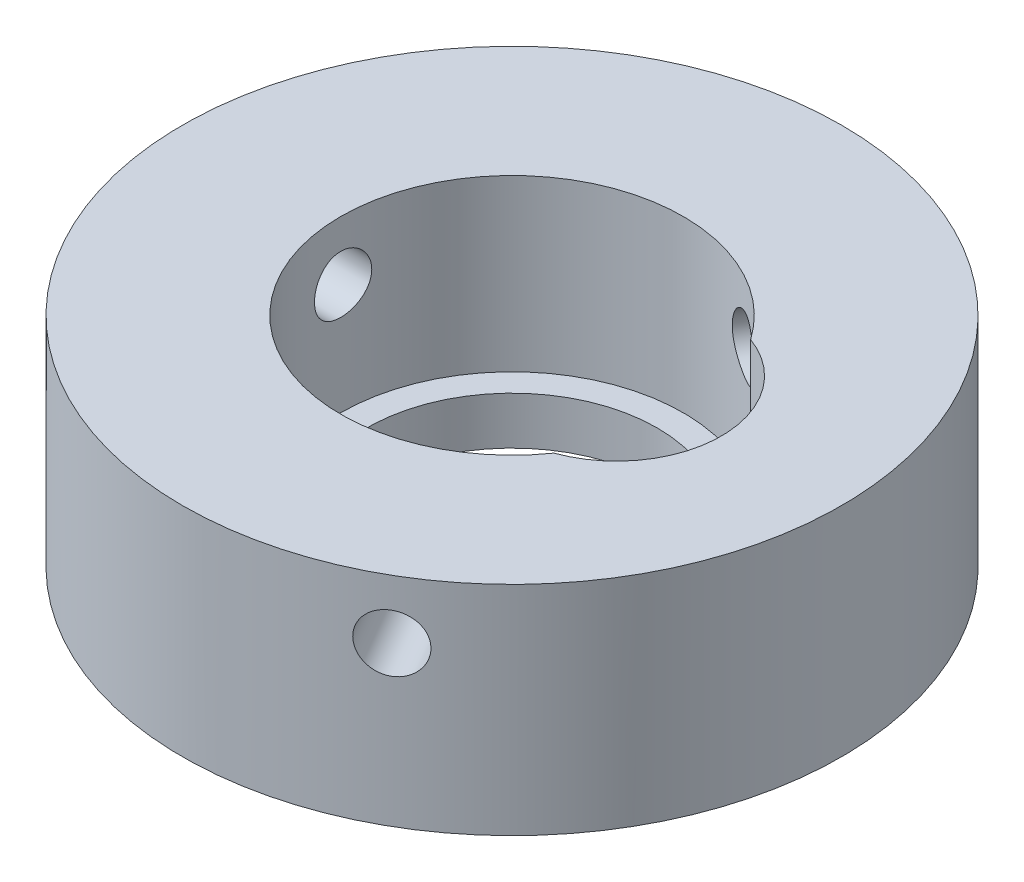
ISO-10303-21;
HEADER;
FILE_DESCRIPTION(('STEP AP214'),'2;1');
FILE_NAME('part.step','',(''),(''),'','','');
FILE_SCHEMA(('AUTOMOTIVE_DESIGN { 1 0 10303 214 1 1 1 1 }'));
ENDSEC;
DATA;
#1=APPLICATION_CONTEXT('core data for automotive mechanical design processes');
#2=APPLICATION_PROTOCOL_DEFINITION('international standard','automotive_design',2000,#1);
#3=PRODUCT_CONTEXT('',#1,'mechanical');
#4=PRODUCT('Part','Part','',(#3));
#5=PRODUCT_RELATED_PRODUCT_CATEGORY('part','',(#4));
#6=PRODUCT_DEFINITION_FORMATION('','',#4);
#7=PRODUCT_DEFINITION_CONTEXT('part definition',#1,'design');
#8=PRODUCT_DEFINITION('design','',#6,#7);
#9=PRODUCT_DEFINITION_SHAPE('','',#8);
#10=(LENGTH_UNIT() NAMED_UNIT(*) SI_UNIT(.MILLI.,.METRE.));
#11=(NAMED_UNIT(*) PLANE_ANGLE_UNIT() SI_UNIT($,.RADIAN.));
#12=(NAMED_UNIT(*) SI_UNIT($,.STERADIAN.) SOLID_ANGLE_UNIT());
#13=UNCERTAINTY_MEASURE_WITH_UNIT(LENGTH_MEASURE(1.E-05),#10,'distance_accuracy_value','');
#14=(GEOMETRIC_REPRESENTATION_CONTEXT(3) GLOBAL_UNCERTAINTY_ASSIGNED_CONTEXT((#13)) GLOBAL_UNIT_ASSIGNED_CONTEXT((#10,
#11,#12)) REPRESENTATION_CONTEXT('',''));
#15=CARTESIAN_POINT('',(0.,0.,0.));
#16=DIRECTION('',(0.,0.,1.));
#17=DIRECTION('',(1.,0.,0.));
#18=AXIS2_PLACEMENT_3D('',#15,#16,#17);
#19=CARTESIAN_POINT('',(0.,6.5,0.));
#20=DIRECTION('',(0.,1.,0.));
#21=DIRECTION('',(0.,0.,1.));
#22=AXIS2_PLACEMENT_3D('',#19,#20,#21);
#23=PLANE('',#22);
#24=CARTESIAN_POINT('',(4.,6.5,0.));
#25=DIRECTION('',(0.,1.,0.));
#26=DIRECTION('',(0.,0.,-1.));
#27=AXIS2_PLACEMENT_3D('',#24,#25,#26);
#28=CIRCLE('',#27,4.);
#29=CARTESIAN_POINT('',(5.3628125,6.5,3.76068372637792));
#30=VERTEX_POINT('',#29);
#31=CARTESIAN_POINT('',(5.3628125,6.5,-3.76068372637792));
#32=VERTEX_POINT('',#31);
#33=EDGE_CURVE('E72',#30,#32,#28,.T.);
#34=ORIENTED_EDGE('',*,*,#33,.F.);
#35=CARTESIAN_POINT('',(0.,6.5,0.));
#36=DIRECTION('',(0.,1.,0.));
#37=DIRECTION('',(0.,0.,1.));
#38=AXIS2_PLACEMENT_3D('',#35,#36,#37);
#39=CIRCLE('',#38,6.55);
#40=EDGE_CURVE('E49',#32,#30,#39,.T.);
#41=ORIENTED_EDGE('',*,*,#40,.F.);
#42=EDGE_LOOP('',(#34,#41));
#43=FACE_BOUND('',#42,.T.);
#44=CARTESIAN_POINT('',(0.,6.5,0.));
#45=DIRECTION('',(0.,1.,0.));
#46=DIRECTION('',(0.,0.,1.));
#47=AXIS2_PLACEMENT_3D('',#44,#45,#46);
#48=CIRCLE('',#47,12.6);
#49=CARTESIAN_POINT('',(0.,6.5,12.6));
#50=VERTEX_POINT('',#49);
#51=EDGE_CURVE('E11',#50,#50,#48,.T.);
#52=ORIENTED_EDGE('',*,*,#51,.T.);
#53=EDGE_LOOP('',(#52));
#54=FACE_BOUND('',#53,.T.);
#55=ADVANCED_FACE('F35',(#43,#54),#23,.T.);
#56=CARTESIAN_POINT('',(0.,6.5,0.));
#57=DIRECTION('',(0.,-1.,0.));
#58=DIRECTION('',(0.,0.,-1.));
#59=AXIS2_PLACEMENT_3D('',#56,#57,#58);
#60=CYLINDRICAL_SURFACE('',#59,12.6);
#61=CARTESIAN_POINT('',(7.22446254968569,4.25,-10.3231361934341));
#62=CARTESIAN_POINT('',(7.22446054632938,4.31138190041357,-10.3231380778271));
#63=CARTESIAN_POINT('',(7.22020525135826,4.3728053496494,-10.3261196405773));
#64=CARTESIAN_POINT('',(7.20327426813458,4.49395204996664,-10.3379370419349));
#65=CARTESIAN_POINT('',(7.19058909087164,4.55367330589645,-10.3467794777445));
#66=CARTESIAN_POINT('',(7.1571126381412,4.66964351735145,-10.3699638739023));
#67=CARTESIAN_POINT('',(7.13632602160388,4.72589444707592,-10.3843026733548));
#68=CARTESIAN_POINT('',(7.08715996500609,4.83335975790643,-10.4179194769588));
#69=CARTESIAN_POINT('',(7.05878212519421,4.88457519739809,-10.4371964400971));
#70=CARTESIAN_POINT('',(6.99504860636771,4.98067122809165,-10.4800175655039));
#71=CARTESIAN_POINT('',(6.95967588767177,5.02553588138808,-10.5035721364489));
#72=CARTESIAN_POINT('',(6.88287680265401,5.10751980423676,-10.5540567665992));
#73=CARTESIAN_POINT('',(6.84145016953447,5.14463873225758,-10.5809869745623));
#74=CARTESIAN_POINT('',(6.75352876147299,5.21013105315307,-10.6373199291252));
#75=CARTESIAN_POINT('',(6.70702610678926,5.23849057940443,-10.6667265032577));
#76=CARTESIAN_POINT('',(6.61022938958786,5.28557037598155,-10.7269806566784));
#77=CARTESIAN_POINT('',(6.55993539862725,5.30429082818142,-10.7578282087657));
#78=CARTESIAN_POINT('',(6.45705377709052,5.33151498346011,-10.8198916159108));
#79=CARTESIAN_POINT('',(6.40447231051077,5.340044570597,-10.8511063336461));
#80=CARTESIAN_POINT('',(6.29836533493609,5.34672490320569,-10.9130365567474));
#81=CARTESIAN_POINT('',(6.24483984489786,5.34487585685233,-10.9437520721141));
#82=CARTESIAN_POINT('',(6.1385239494038,5.33087254705099,-11.0037375601458));
#83=CARTESIAN_POINT('',(6.08573194957235,5.318746117655,-11.0330112114242));
#84=CARTESIAN_POINT('',(5.98227325885859,5.28457556248007,-11.089449101339));
#85=CARTESIAN_POINT('',(5.93160658969815,5.26253133536357,-11.1166133184184));
#86=CARTESIAN_POINT('',(5.83383422975394,5.20912001799512,-11.1682336036245));
#87=CARTESIAN_POINT('',(5.7867333948661,5.17774049171027,-11.1926859991652));
#88=CARTESIAN_POINT('',(5.69758648682256,5.10655835504873,-11.23832817445));
#89=CARTESIAN_POINT('',(5.65554052534332,5.06675555863177,-11.259517882115));
#90=CARTESIAN_POINT('',(5.57766287630413,4.97969992891863,-11.2982998622308));
#91=CARTESIAN_POINT('',(5.5418521896816,4.93242290415074,-11.3158800116916));
#92=CARTESIAN_POINT('',(5.47774137850233,4.83184505934226,-11.3470535494254));
#93=CARTESIAN_POINT('',(5.44944126095321,4.77854423368131,-11.3606469339787));
#94=CARTESIAN_POINT('',(5.40125625508503,4.66741445565701,-11.3836350598867));
#95=CARTESIAN_POINT('',(5.3813725376264,4.60958487459407,-11.3930292170696));
#96=CARTESIAN_POINT('',(5.35067792689323,4.49104749407922,-11.4074771990805));
#97=CARTESIAN_POINT('',(5.33986682592476,4.43033976054873,-11.4125311232669));
#98=CARTESIAN_POINT('',(5.32769610946084,4.30798167070344,-11.4182179011114));
#99=CARTESIAN_POINT('',(5.32630573053385,4.24633504200532,-11.4188651448478));
#100=CARTESIAN_POINT('',(5.33294098558819,4.12366258093429,-11.4157677501991));
#101=CARTESIAN_POINT('',(5.34096652393116,4.0626367422623,-11.4120231564223));
#102=CARTESIAN_POINT('',(5.36614757583747,3.94303559759384,-11.4002039961788));
#103=CARTESIAN_POINT('',(5.38328873741891,3.88445659514293,-11.3921362361167));
#104=CARTESIAN_POINT('',(5.42613323851181,3.77129738297897,-11.3717912930023));
#105=CARTESIAN_POINT('',(5.45183672720363,3.71671724295782,-11.3595140366083));
#106=CARTESIAN_POINT('',(5.51106026402271,3.61295036659126,-11.3309000086631));
#107=CARTESIAN_POINT('',(5.54460031712976,3.5637779154396,-11.3145528404228));
#108=CARTESIAN_POINT('',(5.61840497720261,3.47236671658474,-11.2780856243806));
#109=CARTESIAN_POINT('',(5.65866970993669,3.43012809859083,-11.2579655060141));
#110=CARTESIAN_POINT('',(5.74479773013916,3.35366783154427,-11.214260247924));
#111=CARTESIAN_POINT('',(5.79067587205511,3.31946818507753,-11.1906658794339));
#112=CARTESIAN_POINT('',(5.88654342688131,3.26020771846546,-11.1405353745494));
#113=CARTESIAN_POINT('',(5.93653279562105,3.23514680015045,-11.1139992697596));
#114=CARTESIAN_POINT('',(6.03904970180259,3.19491286340649,-11.0586285371013));
#115=CARTESIAN_POINT('',(6.0915736562985,3.17972630217402,-11.0297971185005));
#116=CARTESIAN_POINT('',(6.19767205109089,3.15962792029821,-10.9705310595895));
#117=CARTESIAN_POINT('',(6.251246469565,3.15471588643926,-10.9400964525619));
#118=CARTESIAN_POINT('',(6.35771920527344,3.15530858008166,-10.8785649328174));
#119=CARTESIAN_POINT('',(6.41061916839156,3.16077904446588,-10.8474705322635));
#120=CARTESIAN_POINT('',(6.51443964881388,3.18190991865538,-10.7854408430448));
#121=CARTESIAN_POINT('',(6.56536016362865,3.19757034127556,-10.7545055545803));
#122=CARTESIAN_POINT('',(6.66383351813408,3.23862771773234,-10.6937679081021));
#123=CARTESIAN_POINT('',(6.71138659844867,3.2640239750502,-10.6639654692101));
#124=CARTESIAN_POINT('',(6.8018781794154,3.32382826023661,-10.6064758765885));
#125=CARTESIAN_POINT('',(6.84481674380046,3.35823616361917,-10.5787886936458));
#126=CARTESIAN_POINT('',(6.92511255226378,3.4352156861183,-10.526401360722));
#127=CARTESIAN_POINT('',(6.96245176847016,3.47781270757594,-10.5017109057798));
#128=CARTESIAN_POINT('',(7.03045902743075,3.56991427912192,-10.4563053996972));
#129=CARTESIAN_POINT('',(7.06112545546964,3.61942049638614,-10.4355913109207));
#130=CARTESIAN_POINT('',(7.11507168024247,3.72403940057251,-10.3988857592597));
#131=CARTESIAN_POINT('',(7.13833654848251,3.77916312586256,-10.3829038453234));
#132=CARTESIAN_POINT('',(7.17680142000273,3.89333498043019,-10.3563542166863));
#133=CARTESIAN_POINT('',(7.19201066076509,3.95237852695042,-10.3457803010513));
#134=CARTESIAN_POINT('',(7.21014281671796,4.05147307579422,-10.3331462381805));
#135=CARTESIAN_POINT('',(7.21550646863618,4.09088746924477,-10.3293990996287));
#136=CARTESIAN_POINT('',(7.22266698112272,4.170195387516,-10.3243934683269));
#137=CARTESIAN_POINT('',(7.2244638522868,4.21008891091298,-10.323134968184));
#138=CARTESIAN_POINT('',(7.22446254968569,4.25,-10.3231361934341));
#139=B_SPLINE_CURVE_WITH_KNOTS('',3,(#61,#62,#63,#64,#65,#66,#67,#68,#69,#70,#71,#72,#73,#74,
#75,#76,#77,#78,#79,#80,#81,#82,#83,#84,#85,#86,#87,#88,#89,#90,#91,#92,#93,#94,#95,#96,#97,#98,
#99,#100,#101,#102,#103,#104,#105,#106,#107,#108,#109,#110,#111,#112,#113,#114,#115,#116,#117,
#118,#119,#120,#121,#122,#123,#124,#125,#126,#127,#128,#129,#130,#131,#132,#133,#134,#135,#136,
#137,#138),.UNSPECIFIED.,.T.,.F.,(4,2,2,2,2,2,2,2,2,2,2,2,2,2,2,2,2,2,2,2,2,2,2,2,2,2,2,2,2,2,2,
2,2,2,2,2,2,2,4),(0.,0.183999973409161,0.368207416119459,0.552309081784561,0.736371968905574,
0.920888887003559,1.10541393926801,1.29022962530517,1.47504182403439,1.65938360844299,
1.84372169533334,2.02756213218092,2.2114044475064,2.39549277374776,2.57958516627414,
2.76428608320509,2.94898717246786,3.13371394826874,3.31843649511618,3.5025555372855,
3.6866727093563,3.87050085489987,4.05433220342594,4.23863806050253,4.42294736494475,
4.60775539647024,4.79256144270026,4.97711348748461,5.16166170243178,5.34560195152885,
5.52954243194962,5.71346975539987,5.89739453823011,6.08189933330301,6.26644872625743,
6.4513680183193,6.63607479964511,6.75571366870821,6.87535218236229),.UNSPECIFIED.);
#140=CARTESIAN_POINT('',(7.22446254968569,4.25,-10.3231361934341));
#141=VERTEX_POINT('',#140);
#142=EDGE_CURVE('E121',#141,#141,#139,.T.);
#143=ORIENTED_EDGE('',*,*,#142,.T.);
#144=EDGE_LOOP('',(#143));
#145=FACE_BOUND('',#144,.T.);
#146=CARTESIAN_POINT('',(5.32786691539762,4.25,11.4181361934342));
#147=CARTESIAN_POINT('',(5.32786954900797,4.31138190041357,11.4181354006732));
#148=CARTESIAN_POINT('',(5.33257930557823,4.3728053496494,11.4159409885028));
#149=CARTESIAN_POINT('',(5.35127896697244,4.49395204996664,11.4071870275988));
#150=CARTESIAN_POINT('',(5.36527932964632,4.55367330589645,11.4006225597424));
#151=CARTESIAN_POINT('',(5.40209583205566,4.66964351735145,11.3832232993281));
#152=CARTESIAN_POINT('',(5.42490690490988,4.72589444707592,11.3723909610743));
#153=CARTESIAN_POINT('',(5.47860293912391,4.83335975790643,11.3466203088587));
#154=CARTESIAN_POINT('',(5.50948619881542,4.88457519739809,11.3316828602463));
#155=CARTESIAN_POINT('',(5.5784371406496,4.98067122809165,11.2978985765733));
#156=CARTESIAN_POINT('',(5.61652235681122,5.02553588138808,11.2790421890543));
#157=CARTESIAN_POINT('',(5.69864287153093,5.10751980423676,11.2377745455166));
#158=CARTESIAN_POINT('',(5.74267843231593,5.14463873225757,11.2153631328234));
#159=CARTESIAN_POINT('',(5.83542490606832,5.21013105315307,11.1673874371871));
#160=CARTESIAN_POINT('',(5.88414307364724,5.23849057940443,11.1418182439538));
#161=CARTESIAN_POINT('',(5.98472305979383,5.28557037598155,11.0881169045648));
#162=CARTESIAN_POINT('',(6.03658481902625,5.30429082818142,11.0599848067789));
#163=CARTESIAN_POINT('',(6.14177411702773,5.33151498346011,11.0019184125181));
#164=CARTESIAN_POINT('',(6.1950975888483,5.340044570597,10.9719888855594));
#165=CARTESIAN_POINT('',(6.30178422310341,5.34672490320569,10.9110626607437));
#166=CARTESIAN_POINT('',(6.35514738472039,5.34487585685233,10.8800659843039));
#167=CARTESIAN_POINT('',(6.46025428896133,5.33087254705099,10.8179864619958));
#168=CARTESIAN_POINT('',(6.51200201454566,5.318746117655,10.7869040746644));
#169=CARTESIAN_POINT('',(6.61260800630471,5.28457556248007,10.7255251652214));
#170=CARTESIAN_POINT('',(6.66146624294959,5.26253133536357,10.695228651143));
#171=CARTESIAN_POINT('',(6.75505690126086,5.20912001799512,10.6363654462464));
#172=CARTESIAN_POINT('',(6.7997837144264,5.17774049171027,10.6078011244645));
#173=CARTESIAN_POINT('',(6.88388445172878,5.10655835504873,10.5534187250723));
#174=CARTESIAN_POINT('',(6.92325825760505,5.06675555863177,10.5276007081372));
#175=CARTESIAN_POINT('',(6.99578326211397,4.97969992891863,10.4795476757402));
#176=CARTESIAN_POINT('',(7.0289134614606,4.93242290415074,10.4573247861285));
#177=CARTESIAN_POINT('',(7.08796594265359,4.83184505934226,10.417389963857));
#178=CARTESIAN_POINT('',(7.11388821777471,4.77854423368131,10.399678035406));
#179=CARTESIAN_POINT('',(7.15788902173051,4.66741445565701,10.3694426591966));
#180=CARTESIAN_POINT('',(7.17596645922734,4.60958487459407,10.3569199333472));
#181=CARTESIAN_POINT('',(7.2038260840488,4.49104749407923,10.3375616116985));
#182=CARTESIAN_POINT('',(7.21360846126725,4.43033976054873,10.3307258857101));
#183=CARTESIAN_POINT('',(7.22461871357824,4.30798167070344,10.3230291249923));
#184=CARTESIAN_POINT('',(7.22587443255992,4.24633504200533,10.3221486433889));
#185=CARTESIAN_POINT('',(7.2198743825814,4.12366258093429,10.3263462455022));
#186=CARTESIAN_POINT('',(7.21261870007232,4.06263674226229,10.3314242686978));
#187=CARTESIAN_POINT('',(7.18979248109696,3.94303559759384,10.347322119221));
#188=CARTESIAN_POINT('',(7.1742350151408,3.88445659514293,10.3581329205698));
#189=CARTESIAN_POINT('',(7.1351935270187,3.77129738297897,10.3850648753715));
#190=CARTESIAN_POINT('',(7.11170936674686,3.71671724295782,10.4011861213475));
#191=CARTESIAN_POINT('',(7.05731712323215,3.61295036659126,10.4381681947622));
#192=CARTESIAN_POINT('',(7.02639003370262,3.5637779154396,10.4590411486771));
#193=CARTESIAN_POINT('',(6.95790616816829,3.47236671658474,10.5047242511967));
#194=CARTESIAN_POINT('',(6.92034926816874,3.43012809859083,10.5295344734378));
#195=CARTESIAN_POINT('',(6.83943539428253,3.35366783154427,10.5822708978657));
#196=CARTESIAN_POINT('',(6.79606300082586,3.31946818507754,10.6102053499983));
#197=CARTESIAN_POINT('',(6.70471493267826,3.26020771846546,10.6681638354342));
#198=CARTESIAN_POINT('',(6.65673930744296,3.23514680015045,10.6981878462871));
#199=CARTESIAN_POINT('',(6.55752839324394,3.19491286340649,10.7592847250286));
#200=CARTESIAN_POINT('',(6.50629767506051,3.17972630217402,10.7903560946288));
#201=CARTESIAN_POINT('',(6.40192256506521,3.15962792029821,10.8526069703643));
#202=CARTESIAN_POINT('',(6.34877821298811,3.15471588643926,10.8837864742421));
#203=CARTESIAN_POINT('',(6.24225398590167,3.15530858008166,10.9452288083037));
#204=CARTESIAN_POINT('',(6.18887546354746,3.16077904446588,10.9754943199463));
#205=CARTESIAN_POINT('',(6.08324593668409,3.18190991865538,11.0343906488158));
#206=CARTESIAN_POINT('',(6.03099493359297,3.19757034127556,11.0630214639869));
#207=CARTESIAN_POINT('',(5.9291579115241,3.23862771773234,11.1179330673454));
#208=CARTESIAN_POINT('',(5.8795717021916,3.2640239750502,11.1442140234801));
#209=CARTESIAN_POINT('',(5.78453846404473,3.32382826023661,11.1938372351151));
#210=CARTESIAN_POINT('',(5.73909137806461,3.35823616361917,11.2171795312032));
#211=CARTESIAN_POINT('',(5.65357471268443,3.4352156861183,11.260524074688));
#212=CARTESIAN_POINT('',(5.61352254337026,3.47781270757594,11.280515557009));
#213=CARTESIAN_POINT('',(5.54019659215071,3.56991427912192,11.3167088178693));
#214=CARTESIAN_POINT('',(5.50692445103457,3.61942049638614,11.332909679206));
#215=CARTESIAN_POINT('',(5.44816339844988,3.72403940057251,11.3612757044671));
#216=CARTESIAN_POINT('',(5.42269022085992,3.77916312586256,11.3734327144105));
#217=CARTESIAN_POINT('',(5.38046513223905,3.89333498043019,11.3934694559818));
#218=CARTESIAN_POINT('',(5.36370323230042,3.95237852695042,11.4013540870367));
#219=CARTESIAN_POINT('',(5.34369573492489,4.05147307579422,11.4107399632819));
#220=CARTESIAN_POINT('',(5.33776879178841,4.09088746924477,11.4135114528242));
#221=CARTESIAN_POINT('',(5.32985353167584,4.170195387516,11.4172098228908));
#222=CARTESIAN_POINT('',(5.32786520299939,4.21008891091298,11.4181367088948));
#223=CARTESIAN_POINT('',(5.32786691539762,4.25,11.4181361934342));
#224=B_SPLINE_CURVE_WITH_KNOTS('',3,(#146,#147,#148,#149,#150,#151,#152,#153,#154,#155,#156,
#157,#158,#159,#160,#161,#162,#163,#164,#165,#166,#167,#168,#169,#170,#171,#172,#173,#174,#175,
#176,#177,#178,#179,#180,#181,#182,#183,#184,#185,#186,#187,#188,#189,#190,#191,#192,#193,#194,
#195,#196,#197,#198,#199,#200,#201,#202,#203,#204,#205,#206,#207,#208,#209,#210,#211,#212,#213,
#214,#215,#216,#217,#218,#219,#220,#221,#222,#223),.UNSPECIFIED.,.T.,.F.,(4,2,2,2,2,2,2,2,2,2,2,
2,2,2,2,2,2,2,2,2,2,2,2,2,2,2,2,2,2,2,2,2,2,2,2,2,2,2,4),(0.,0.183999973409161,
0.368207416119459,0.55230908178456,0.736371968905574,0.920888887003557,1.10541393926801,
1.29022962530517,1.47504182403439,1.65938360844299,1.84372169533334,2.02756213218092,
2.2114044475064,2.39549277374776,2.57958516627414,2.76428608320509,2.94898717246786,
3.13371394826873,3.31843649511618,3.5025555372855,3.6866727093563,3.87050085489987,
4.05433220342594,4.23863806050253,4.42294736494474,4.60775539647024,4.79256144270026,
4.97711348748461,5.16166170243178,5.34560195152885,5.52954243194962,5.71346975539987,
5.89739453823012,6.08189933330302,6.26644872625743,6.4513680183193,6.63607479964511,
6.75571366870821,6.87535218236229),.UNSPECIFIED.);
#225=CARTESIAN_POINT('',(5.32786691539762,4.25,11.4181361934342));
#226=VERTEX_POINT('',#225);
#227=EDGE_CURVE('E126',#226,#226,#224,.T.);
#228=ORIENTED_EDGE('',*,*,#227,.T.);
#229=EDGE_LOOP('',(#228));
#230=FACE_BOUND('',#229,.T.);
#231=CARTESIAN_POINT('',(-12.6,3.155,0.));
#232=CARTESIAN_POINT('',(-12.599999378538,3.15500267670996,-0.0613823939407758));
#233=CARTESIAN_POINT('',(-12.5995466739457,3.16017873204988,-0.122806335110146));
#234=CARTESIAN_POINT('',(-12.5977842727679,3.18075044278816,-0.243954057554232));
#235=CARTESIAN_POINT('',(-12.596473610616,3.19615761281609,-0.303675844063358));
#236=CARTESIAN_POINT('',(-12.5931433735136,3.2367420486149,-0.419647177324462));
#237=CARTESIAN_POINT('',(-12.5911242051424,3.26191371186407,-0.475898693782604));
#238=CARTESIAN_POINT('',(-12.5866032628457,3.32130240521609,-0.583364987291514));
#239=CARTESIAN_POINT('',(-12.5841015907313,3.35551752766176,-0.634580823462938));
#240=CARTESIAN_POINT('',(-12.5788885482659,3.43212365391641,-0.73067640447554));
#241=CARTESIAN_POINT('',(-12.5761766797403,3.47453446015344,-0.775540337473936));
#242=CARTESIAN_POINT('',(-12.5708530566498,3.56628612719011,-0.857522870639881));
#243=CARTESIAN_POINT('',(-12.5682413065323,3.61562729538501,-0.894641127067387));
#244=CARTESIAN_POINT('',(-12.5634083387206,3.71993555089241,-0.960132747049468));
#245=CARTESIAN_POINT('',(-12.5611877482217,3.77491145382139,-0.988492120254343));
#246=CARTESIAN_POINT('',(-12.557394339054,3.88886724132394,-1.03557159645859));
#247=CARTESIAN_POINT('',(-12.5558215080405,3.94784704956782,-1.05429188315734));
#248=CARTESIAN_POINT('',(-12.5535059620276,4.06797732873152,-1.08151569057194));
#249=CARTESIAN_POINT('',(-12.5527611453939,4.12912189577661,-1.09004508156486));
#250=CARTESIAN_POINT('',(-12.5521793446786,4.25197897432415,-1.0967249102072));
#251=CARTESIAN_POINT('',(-12.5523423422039,4.3136914742945,-1.09487555813848));
#252=CARTESIAN_POINT('',(-12.5535558410754,4.43575513222471,-1.08087176586757));
#253=CARTESIAN_POINT('',(-12.5546039187453,4.49610954622208,-1.06874546741439));
#254=CARTESIAN_POINT('',(-12.5574656875802,4.61392316390629,-1.03457573786452));
#255=CARTESIAN_POINT('',(-12.5592793867959,4.6713823371412,-1.01253220248328));
#256=CARTESIAN_POINT('',(-12.5634708300567,4.78186394473554,-0.959122314205401));
#257=CARTESIAN_POINT('',(-12.5658493354153,4.83488025883707,-0.927743363352328));
#258=CARTESIAN_POINT('',(-12.5709017027853,4.93490427142175,-0.856562453127345));
#259=CARTESIAN_POINT('',(-12.5735755713087,4.9819118373781,-0.81676030802787));
#260=CARTESIAN_POINT('',(-12.5789281731273,5.06874759138496,-0.729705138366363));
#261=CARTESIAN_POINT('',(-12.581606893055,5.10855139891937,-0.682427789848149));
#262=CARTESIAN_POINT('',(-12.5866589220389,5.17966115485633,-0.581849024191848));
#263=CARTESIAN_POINT('',(-12.5890322308667,5.21096709690525,-0.528547602549758));
#264=CARTESIAN_POINT('',(-12.5932065438654,5.2641910508039,-0.417417667195347));
#265=CARTESIAN_POINT('',(-12.5950074802952,5.28610795155474,-0.359588618641005));
#266=CARTESIAN_POINT('',(-12.5978333752601,5.31991445401443,-0.241052394984881));
#267=CARTESIAN_POINT('',(-12.5988583513109,5.33180428206463,-0.180345284882322));
#268=CARTESIAN_POINT('',(-12.6000145905234,5.34518849093118,-0.0579874784925198));
#269=CARTESIAN_POINT('',(-12.6001487482587,5.34671654105603,0.00365950866383441));
#270=CARTESIAN_POINT('',(-12.5995159719086,5.33942206590252,0.126332764824102));
#271=CARTESIAN_POINT('',(-12.5987490469757,5.33059964575668,0.187359040126403));
#272=CARTESIAN_POINT('',(-12.5964022006606,5.30288257777896,0.306962323456914));
#273=CARTESIAN_POINT('',(-12.5948235416419,5.28400356775832,0.365542982277124));
#274=CARTESIAN_POINT('',(-12.5910305201997,5.23672521747446,0.478705308533921));
#275=CARTESIAN_POINT('',(-12.5888161468772,5.20832571398485,0.53328690738811));
#276=CARTESIAN_POINT('',(-12.5839926038596,5.1427281447199,0.637054767799256));
#277=CARTESIAN_POINT('',(-12.5813824410779,5.10550781024721,0.686226905162626));
#278=CARTESIAN_POINT('',(-12.5760638001585,5.02335724810114,0.777637371912563));
#279=CARTESIAN_POINT('',(-12.5733553201633,4.97842687471635,0.819875570225645));
#280=CARTESIAN_POINT('',(-12.5681367100148,4.88198537747339,0.896334944540244));
#281=CARTESIAN_POINT('',(-12.5656271362536,4.83045678031383,0.93053412397085));
#282=CARTESIAN_POINT('',(-12.5610984916624,4.72236836010913,0.989793770867939));
#283=CARTESIAN_POINT('',(-12.5590794155689,4.66580859106111,1.01485433640002));
#284=CARTESIAN_POINT('',(-12.5557635774664,4.5493407493914,1.05508803672387));
#285=CARTESIAN_POINT('',(-12.5544658376156,4.48943733130951,1.07027456151013));
#286=CARTESIAN_POINT('',(-12.5527363881166,4.36791906937635,1.09037265700947));
#287=CARTESIAN_POINT('',(-12.5523046602146,4.30630426162563,1.09528444429435));
#288=CARTESIAN_POINT('',(-12.5523564088244,4.18333084229994,1.09469103731639));
#289=CARTESIAN_POINT('',(-12.5528368490467,4.12197205972793,1.08922040254002));
#290=CARTESIAN_POINT('',(-12.5546523448622,4.00104834308837,1.06808958522424));
#291=CARTESIAN_POINT('',(-12.5559874016984,3.94148341162987,1.05242938786556));
#292=CARTESIAN_POINT('',(-12.5593608962419,3.82583649008619,1.01137289762092));
#293=CARTESIAN_POINT('',(-12.5613992830778,3.7697542484459,0.985977308876168));
#294=CARTESIAN_POINT('',(-12.5659498535577,3.66264347154389,0.926174717432325));
#295=CARTESIAN_POINT('',(-12.5684620307233,3.61161486719464,0.891767837948725));
#296=CARTESIAN_POINT('',(-12.5736870870937,3.51588292404015,0.814789435013228));
#297=CARTESIAN_POINT('',(-12.5764005796017,3.47120023269641,0.772192275503083));
#298=CARTESIAN_POINT('',(-12.5817169144785,3.3896000088752,0.680090118497114));
#299=CARTESIAN_POINT('',(-12.5843197299712,3.35268435399799,0.630583455500698));
#300=CARTESIAN_POINT('',(-12.5891265485144,3.28761202617025,0.525964194765321));
#301=CARTESIAN_POINT('',(-12.591329747723,3.25947292755834,0.470840638618948));
#302=CARTESIAN_POINT('',(-12.5950798334602,3.21288618368963,0.356669144163046));
#303=CARTESIAN_POINT('',(-12.5966274711532,3.19442744054947,0.297625787554577));
#304=CARTESIAN_POINT('',(-12.5984964277923,3.17240694284877,0.19853071222781));
#305=CARTESIAN_POINT('',(-12.5990576881621,3.16588806342225,0.159115562869924));
#306=CARTESIAN_POINT('',(-12.5998096757652,3.15718372812955,0.0798061298718351));
#307=CARTESIAN_POINT('',(-12.6000004040849,3.15499825955892,0.0399118476366721));
#308=CARTESIAN_POINT('',(-12.6,3.155,0.));
#309=B_SPLINE_CURVE_WITH_KNOTS('',3,(#231,#232,#233,#234,#235,#236,#237,#238,#239,#240,#241,
#242,#243,#244,#245,#246,#247,#248,#249,#250,#251,#252,#253,#254,#255,#256,#257,#258,#259,#260,
#261,#262,#263,#264,#265,#266,#267,#268,#269,#270,#271,#272,#273,#274,#275,#276,#277,#278,#279,
#280,#281,#282,#283,#284,#285,#286,#287,#288,#289,#290,#291,#292,#293,#294,#295,#296,#297,#298,
#299,#300,#301,#302,#303,#304,#305,#306,#307,#308),.UNSPECIFIED.,.T.,.F.,(4,2,2,2,2,2,2,2,2,2,2,
2,2,2,2,2,2,2,2,2,2,2,2,2,2,2,2,2,2,2,2,2,2,2,2,2,2,2,4),(0.,0.184001455768908,
0.368210348134743,0.552313703894763,0.736378255235361,0.92089323367748,1.10541639884207,
1.29023279201642,1.47504566287414,1.65938837013705,1.84372734247863,2.027563157432,
2.21140090555318,2.39548787312269,2.57957890014829,2.76428176904525,2.94898477603945,
3.13370963474856,3.31843032354753,3.50255049660937,3.68666879952891,3.87050163408092,
4.05433762056038,4.2386427506131,4.42295136421743,4.60775856542627,4.79256378342831,
4.97711786506645,5.16166805661882,5.34560502175183,5.52954225439556,5.7134661857399,
5.89738760233969,6.08189436186204,6.26644567285725,6.45136419485204,6.63607025405664,
6.75571139423461,6.87535218365478),.UNSPECIFIED.);
#310=CARTESIAN_POINT('',(-12.6,3.155,0.));
#311=VERTEX_POINT('',#310);
#312=EDGE_CURVE('E84',#311,#311,#309,.T.);
#313=ORIENTED_EDGE('',*,*,#312,.T.);
#314=EDGE_LOOP('',(#313));
#315=FACE_BOUND('',#314,.T.);
#316=ORIENTED_EDGE('',*,*,#51,.F.);
#317=EDGE_LOOP('',(#316));
#318=FACE_BOUND('',#317,.T.);
#319=CARTESIAN_POINT('',(0.,-1.82,0.));
#320=DIRECTION('',(0.,-1.,0.));
#321=DIRECTION('',(0.,0.,-1.));
#322=AXIS2_PLACEMENT_3D('',#319,#320,#321);
#323=CIRCLE('',#322,12.6);
#324=CARTESIAN_POINT('',(0.,-1.82,-12.6));
#325=VERTEX_POINT('',#324);
#326=EDGE_CURVE('E95',#325,#325,#323,.T.);
#327=ORIENTED_EDGE('',*,*,#326,.F.);
#328=EDGE_LOOP('',(#327));
#329=FACE_BOUND('',#328,.T.);
#330=ADVANCED_FACE('F37',(#145,#230,#315,#318,#329),#60,.T.);
#331=CARTESIAN_POINT('',(0.,6.5,0.));
#332=DIRECTION('',(0.,-1.,0.));
#333=DIRECTION('',(0.,0.,-1.));
#334=AXIS2_PLACEMENT_3D('',#331,#332,#333);
#335=CYLINDRICAL_SURFACE('',#334,6.55);
#336=CARTESIAN_POINT('',(4.17720920490302,4.25,-5.04513857673636));
#337=CARTESIAN_POINT('',(4.17720763442066,4.31104375274868,-5.04514075863529));
#338=CARTESIAN_POINT('',(4.17321100280221,4.37212077222241,-5.04845721292756));
#339=CARTESIAN_POINT('',(4.15730061069998,4.49256089977418,-5.06156634230577));
#340=CARTESIAN_POINT('',(4.14537956249896,4.55192237766301,-5.07136497871302));
#341=CARTESIAN_POINT('',(4.11388352340818,4.66717096232809,-5.09694723532997));
#342=CARTESIAN_POINT('',(4.09431494598096,4.72306093502123,-5.11272584021259));
#343=CARTESIAN_POINT('',(4.0479325314058,4.82987452946523,-5.1495256680281));
#344=CARTESIAN_POINT('',(4.02111950377131,4.88079870524226,-5.17054630518264));
#345=CARTESIAN_POINT('',(3.96052467729653,4.97674617972922,-5.21710772293876));
#346=CARTESIAN_POINT('',(3.92668313495532,5.02171308911399,-5.24268696896483));
#347=CARTESIAN_POINT('',(3.85288898328095,5.10397976669032,-5.29715447476192));
#348=CARTESIAN_POINT('',(3.8129360111323,5.14127907937355,-5.32604293096427));
#349=CARTESIAN_POINT('',(3.72754234282298,5.20736350627961,-5.38615508066386));
#350=CARTESIAN_POINT('',(3.68207012106732,5.23609612532448,-5.41739176051235));
#351=CARTESIAN_POINT('',(3.58692594582601,5.28389411254552,-5.48085104192294));
#352=CARTESIAN_POINT('',(3.53725426731335,5.30296011310366,-5.51307357884484));
#353=CARTESIAN_POINT('',(3.43548421924021,5.33071114026102,-5.5770534872672));
#354=CARTESIAN_POINT('',(3.38341266620997,5.33949091782806,-5.60881239978686));
#355=CARTESIAN_POINT('',(3.27786354431936,5.34671492260857,-5.67114324051757));
#356=CARTESIAN_POINT('',(3.22438607183438,5.34515985644222,-5.70171524973654));
#357=CARTESIAN_POINT('',(3.11812112393676,5.33183218083777,-5.76050978742601));
#358=CARTESIAN_POINT('',(3.0653320830669,5.32016154323126,-5.78875269256508));
#359=CARTESIAN_POINT('',(2.96146928046502,5.28709459702334,-5.84256990312916));
#360=CARTESIAN_POINT('',(2.91039557127571,5.26569799079493,-5.86814412685968));
#361=CARTESIAN_POINT('',(2.81127869080338,5.21368523331431,-5.91627116338728));
#362=CARTESIAN_POINT('',(2.76325055306858,5.18302709306493,-5.93880952504978));
#363=CARTESIAN_POINT('',(2.6719651281604,5.11339230702878,-5.98043669693561));
#364=CARTESIAN_POINT('',(2.62870822985654,5.07441498396379,-5.99952522606865));
#365=CARTESIAN_POINT('',(2.54784574635378,4.98868276610222,-6.03431411606667));
#366=CARTESIAN_POINT('',(2.51031558530882,4.94183874583069,-6.04997027728501));
#367=CARTESIAN_POINT('',(2.44281488239248,4.84200308343777,-6.07753971333678));
#368=CARTESIAN_POINT('',(2.41284441108274,4.78901138394108,-6.0894529532343));
#369=CARTESIAN_POINT('',(2.36149665927335,4.67828287706808,-6.10954976639697));
#370=CARTESIAN_POINT('',(2.34012914510706,4.62054076590139,-6.11772910222427));
#371=CARTESIAN_POINT('',(2.30684007755032,4.50200710875176,-6.1303596078996));
#372=CARTESIAN_POINT('',(2.29491768703008,4.44121583352689,-6.13481110815104));
#373=CARTESIAN_POINT('',(2.28106615086279,4.31909179918925,-6.13997491461838));
#374=CARTESIAN_POINT('',(2.27901865215884,4.25777432294885,-6.14073150662876));
#375=CARTESIAN_POINT('',(2.28467523171337,4.13565540674979,-6.13862915034924));
#376=CARTESIAN_POINT('',(2.29237893091779,4.07485394682475,-6.13577034259919));
#377=CARTESIAN_POINT('',(2.31715956723987,3.95588924376947,-6.12645436881755));
#378=CARTESIAN_POINT('',(2.33417649399019,3.89771166425158,-6.12002023658791));
#379=CARTESIAN_POINT('',(2.37691488431958,3.78519105627726,-6.10354790162447));
#380=CARTESIAN_POINT('',(2.40263687148461,3.7308482587103,-6.09350948210027));
#381=CARTESIAN_POINT('',(2.46215838638082,3.6269852198288,-6.06970420160645));
#382=CARTESIAN_POINT('',(2.49603064006099,3.57751439756434,-6.0559036138108));
#383=CARTESIAN_POINT('',(2.57057578705907,3.48531061570418,-6.0246385641696));
#384=CARTESIAN_POINT('',(2.61124916173632,3.44257813344064,-6.00717384296733));
#385=CARTESIAN_POINT('',(2.69853359664254,3.36460867042644,-5.96847675369393));
#386=CARTESIAN_POINT('',(2.74520235089138,3.32945482737699,-5.94720686282211));
#387=CARTESIAN_POINT('',(2.84263637790807,3.26822297047725,-5.90125541472086));
#388=CARTESIAN_POINT('',(2.89340151747499,3.24214466166693,-5.87657396840536));
#389=CARTESIAN_POINT('',(2.99719690062236,3.1999333996465,-5.82431703906353));
#390=CARTESIAN_POINT('',(3.05021614217835,3.18375700282257,-5.79675482814204));
#391=CARTESIAN_POINT('',(3.15709190476406,3.1616688952286,-5.73924650728816));
#392=CARTESIAN_POINT('',(3.21094835608839,3.15575633446959,-5.70930059497437));
#393=CARTESIAN_POINT('',(3.31723204878471,3.15438831308759,-5.64820182168057));
#394=CARTESIAN_POINT('',(3.36966870802815,3.15880637723994,-5.61706810104577));
#395=CARTESIAN_POINT('',(3.47231960331304,3.17770055288412,-5.55419843178802));
#396=CARTESIAN_POINT('',(3.52253385198344,3.19217660721312,-5.5224624865887));
#397=CARTESIAN_POINT('',(3.61937167774602,3.23072719645119,-5.45948567400047));
#398=CARTESIAN_POINT('',(3.66599923079549,3.25479091473684,-5.42824428981431));
#399=CARTESIAN_POINT('',(3.75460717928741,3.3118196420598,-5.36733816359189));
#400=CARTESIAN_POINT('',(3.79658735212385,3.34478507722276,-5.33767349711456));
#401=CARTESIAN_POINT('',(3.87542016518344,3.41912952718447,-5.28072096951599));
#402=CARTESIAN_POINT('',(3.91220813614016,3.46060112783787,-5.25346444050614));
#403=CARTESIAN_POINT('',(3.97929575453611,3.55058644286445,-5.20283348685723));
#404=CARTESIAN_POINT('',(4.00959388021061,3.59910180442195,-5.17945997301072));
#405=CARTESIAN_POINT('',(4.06325323242967,3.70220779942541,-5.13747463014293));
#406=CARTESIAN_POINT('',(4.08656351905505,3.7568392390338,-5.11889789838644));
#407=CARTESIAN_POINT('',(4.12544267559606,3.87032997171242,-5.08761738734477));
#408=CARTESIAN_POINT('',(4.14101926973074,3.92918497885237,-5.07490774904797));
#409=CARTESIAN_POINT('',(4.16075498311104,4.03188992596486,-5.05872766890814));
#410=CARTESIAN_POINT('',(4.16691803180274,4.07511845556101,-5.05364450526679));
#411=CARTESIAN_POINT('',(4.1751456697772,4.16222559746629,-5.0468492056016));
#412=CARTESIAN_POINT('',(4.17721033421732,4.20610419783938,-5.04513700776002));
#413=CARTESIAN_POINT('',(4.17720920490302,4.25,-5.04513857673636));
#414=B_SPLINE_CURVE_WITH_KNOTS('',3,(#336,#337,#338,#339,#340,#341,#342,#343,#344,#345,#346,
#347,#348,#349,#350,#351,#352,#353,#354,#355,#356,#357,#358,#359,#360,#361,#362,#363,#364,#365,
#366,#367,#368,#369,#370,#371,#372,#373,#374,#375,#376,#377,#378,#379,#380,#381,#382,#383,#384,
#385,#386,#387,#388,#389,#390,#391,#392,#393,#394,#395,#396,#397,#398,#399,#400,#401,#402,#403,
#404,#405,#406,#407,#408,#409,#410,#411,#412,#413),.UNSPECIFIED.,.T.,.F.,(4,2,2,2,2,2,2,2,2,2,2,
2,2,2,2,2,2,2,2,2,2,2,2,2,2,2,2,2,2,2,2,2,2,2,2,2,2,2,4),(0.,0.182970736228487,
0.366109975358258,0.549095956514291,0.732061498797736,0.916651074472811,1.10125161287983,
1.28696113894776,1.47265851448845,1.65663155418578,1.84059201529678,2.02271931772003,
2.2048521938455,2.38782352397705,2.57080975578828,2.75602950486062,2.94125098269773,
3.12668214058236,3.31209686169781,3.49528372296043,3.67846346349896,3.86047653766628,
4.04250056137625,4.22621332516679,4.4099390970061,4.59558793958968,4.78123074791664,
4.96605311786988,5.1508601812193,5.33341656534684,5.51597191195568,5.6983218835813,
5.88068058585749,6.06514092461773,6.24964446913736,6.43546201072366,6.62109358715697,
6.75266797712685,6.88423995422556),.UNSPECIFIED.);
#415=CARTESIAN_POINT('',(4.17720920490302,4.25,-5.04513857673636));
#416=VERTEX_POINT('',#415);
#417=EDGE_CURVE('E40',#416,#416,#414,.T.);
#418=ORIENTED_EDGE('',*,*,#417,.F.);
#419=EDGE_LOOP('',(#418));
#420=FACE_BOUND('',#419,.T.);
#421=CARTESIAN_POINT('',(2.28061357061502,4.25,6.1401385767364));
#422=CARTESIAN_POINT('',(2.2806162454361,4.31104375274868,6.14013830760825));
#423=CARTESIAN_POINT('',(2.28548669491292,4.37212077222241,6.13833535024324));
#424=CARTESIAN_POINT('',(2.30479473002706,4.49256089977418,6.13111111118764));
#425=CARTESIAN_POINT('',(2.31924112217869,4.55192237766301,6.12568649880944));
#426=CARTESIAN_POINT('',(2.3571440258405,4.66717096232809,6.11120125714671));
#427=CARTESIAN_POINT('',(2.38059298721873,4.72306093502122,6.10214367442013));
#428=CARTESIAN_POINT('',(2.43565378024944,4.82987452946523,6.08037523901693));
#429=CARTESIAN_POINT('',(2.46726469984625,4.88079870524226,6.06766479451036));
#430=CARTESIAN_POINT('',(2.53788548369666,4.97674617972922,6.03846884432335));
#431=CARTESIAN_POINT('',(2.57695853173549,5.02171308911399,6.02195083196565));
#432=CARTESIAN_POINT('',(2.66102585127374,5.10397976669033,5.98527697486347));
#433=CARTESIAN_POINT('',(2.70602047429541,5.14127907937355,5.96512091412722));
#434=CARTESIAN_POINT('',(2.80077595716601,5.20736350627961,5.92122390289881));
#435=CARTESIAN_POINT('',(2.85056382632251,5.23609612532448,5.89746214361613));
#436=CARTESIAN_POINT('',(2.95309326375064,5.28389411254552,5.84679451154033));
#437=CARTESIAN_POINT('',(3.00583463855572,5.30296011310366,5.8198888445607));
#438=CARTESIAN_POINT('',(3.11212788861786,5.33071114026102,5.76374335179618));
#439=CARTESIAN_POINT('',(3.16566769017157,5.33949091782806,5.73452752031731));
#440=CARTESIAN_POINT('',(3.27242234262892,5.34671492260857,5.67428471977826));
#441=CARTESIAN_POINT('',(3.32563721549976,5.34515985644222,5.64325787468557));
#442=CARTESIAN_POINT('',(3.42968725269141,5.33183218083777,5.58062699911914));
#443=CARTESIAN_POINT('',(3.48054084645346,5.32016154323126,5.54903180125396));
#444=CARTESIAN_POINT('',(3.57907931926371,5.28709459702334,5.48599258097453));
#445=CARTESIAN_POINT('',(3.62676410129106,5.26569799079493,5.45454856321634));
#446=CARTESIAN_POINT('',(3.71800177776898,5.21368523331431,5.39277434504724));
#447=CARTESIAN_POINT('',(3.76153464039579,5.18302709306492,5.3624499385037));
#448=CARTESIAN_POINT('',(3.84322754119072,5.11339230702878,5.30420802748087));
#449=CARTESIAN_POINT('',(3.88138714149274,5.07441498396379,5.27629071922732));
#450=CARTESIAN_POINT('',(3.95194644575186,4.98868276610222,5.22365619929985));
#451=CARTESIAN_POINT('',(3.98427015961517,4.94183874583069,5.19898220703596));
#452=CARTESIAN_POINT('',(4.04189634306219,4.84200308343777,5.15430960156299));
#453=CARTESIAN_POINT('',(4.06719874710968,4.78901138394108,5.13431103199412));
#454=CARTESIAN_POINT('',(4.11027697374837,4.67828287706808,5.09989098108131));
#455=CARTESIAN_POINT('',(4.12804424344403,4.62054076590139,5.08547583891123));
#456=CARTESIAN_POINT('',(4.15562711599988,4.50200710875175,5.06296191357646));
#457=CARTESIAN_POINT('',(4.16544342356271,4.44121583352689,5.05486257063781));
#458=CARTESIAN_POINT('',(4.17684117922728,4.31909179918925,5.04544869166917));
#459=CARTESIAN_POINT('',(4.17852015648055,4.25777432294885,5.04405380178253));
#460=CARTESIAN_POINT('',(4.17387117275742,4.13565540674979,5.04790136523551));
#461=CARTESIAN_POINT('',(4.16754352301913,4.07485394682474,5.05314356057463));
#462=CARTESIAN_POINT('',(4.1470853349022,3.95588924376947,5.06994623426068));
#463=CARTESIAN_POINT('',(4.13300474956487,3.89771166425158,5.08146625900597));
#464=CARTESIAN_POINT('',(4.09737009386218,3.78519105627726,5.11024262326636));
#465=CARTESIAN_POINT('',(4.07581557395786,3.7308482587103,5.12749930782499));
#466=CARTESIAN_POINT('',(4.02543883885789,3.6269852198288,5.16714381154993));
#467=CARTESIAN_POINT('',(3.99655105239962,3.57751439756434,5.18957774982257));
#468=CARTESIAN_POINT('',(3.93220215166072,3.48531061570418,5.23850321603116));
#469=CARTESIAN_POINT('',(3.89674057209092,3.44257813344064,5.26499503115815));
#470=CARTESIAN_POINT('',(3.81958569227453,3.36460867042644,5.32123702450521));
#471=CARTESIAN_POINT('',(3.77783104931939,3.32945482737699,5.35101840581177));
#472=CARTESIAN_POINT('',(3.68931891441468,3.26822297047725,5.41242302435062));
#473=CARTESIAN_POINT('',(3.64256158511985,3.24214466166693,5.44404620168448));
#474=CARTESIAN_POINT('',(3.54540806521238,3.1999333996465,5.50780717561473));
#475=CARTESIAN_POINT('',(3.4950288695919,3.18375700282257,5.53994208023085));
#476=CARTESIAN_POINT('',(3.3917873215106,3.1616688952286,5.60374504525197));
#477=CARTESIAN_POINT('',(3.33892517504519,3.15575633446959,5.63541314409963));
#478=CARTESIAN_POINT('',(3.23287023888454,3.15438831308759,5.69690813533576));
#479=CARTESIAN_POINT('',(3.17968931627875,3.15880637723994,5.72675275401277));
#480=CARTESIAN_POINT('',(3.07391713793157,3.17770055288412,5.78421620242182));
#481=CARTESIAN_POINT('',(3.02132587884065,3.19217660721312,5.81183504480268));
#482=CARTESIAN_POINT('',(2.91836744640857,3.2307271964512,5.86421065566621));
#483=CARTESIAN_POINT('',(2.86799783752924,3.25479091473684,5.88897060903027));
#484=CARTESIAN_POINT('',(2.77094761072856,3.3118196420598,5.93525428029028));
#485=CARTESIAN_POINT('',(2.72426716954618,3.34478507722276,5.95677784318324));
#486=CARTESIAN_POINT('',(2.63552842730629,3.41912952718447,5.99657279814535));
#487=CARTESIAN_POINT('',(2.59352959528641,3.46060112783787,6.01480385104263));
#488=CARTESIAN_POINT('',(2.51613809401065,3.55058644286445,6.04758795602847));
#489=CARTESIAN_POINT('',(2.48074697440662,3.59910180442195,6.06214014562638));
#490=CARTESIAN_POINT('',(2.41755692478698,3.70220779942541,6.0876178363648));
#491=CARTESIAN_POINT('',(2.38981385985388,3.7568392390338,6.09851677087364));
#492=CARTESIAN_POINT('',(2.34328456437793,3.87032997171242,6.11654685259503));
#493=CARTESIAN_POINT('',(2.32448939767264,3.92918497885237,6.1236817596717));
#494=CARTESIAN_POINT('',(2.30060918054614,4.03188992596486,6.13268334875093));
#495=CARTESIAN_POINT('',(2.29312550735529,4.07511845556101,6.13547912366203));
#496=CARTESIAN_POINT('',(2.28312678623167,4.16222559746629,6.13920681732846));
#497=CARTESIAN_POINT('',(2.2806116471845,4.20610419783938,6.1401387702631));
#498=CARTESIAN_POINT('',(2.28061357061502,4.25,6.1401385767364));
#499=B_SPLINE_CURVE_WITH_KNOTS('',3,(#421,#422,#423,#424,#425,#426,#427,#428,#429,#430,#431,
#432,#433,#434,#435,#436,#437,#438,#439,#440,#441,#442,#443,#444,#445,#446,#447,#448,#449,#450,
#451,#452,#453,#454,#455,#456,#457,#458,#459,#460,#461,#462,#463,#464,#465,#466,#467,#468,#469,
#470,#471,#472,#473,#474,#475,#476,#477,#478,#479,#480,#481,#482,#483,#484,#485,#486,#487,#488,
#489,#490,#491,#492,#493,#494,#495,#496,#497,#498),.UNSPECIFIED.,.T.,.F.,(4,2,2,2,2,2,2,2,2,2,2,
2,2,2,2,2,2,2,2,2,2,2,2,2,2,2,2,2,2,2,2,2,2,2,2,2,2,2,4),(0.,0.182970736228487,
0.366109975358258,0.54909595651429,0.732061498797736,0.916651074472811,1.10125161287983,
1.28696113894777,1.47265851448845,1.65663155418578,1.84059201529678,2.02271931772003,
2.2048521938455,2.38782352397706,2.57080975578828,2.75602950486062,2.94125098269773,
3.12668214058237,3.31209686169781,3.49528372296044,3.67846346349896,3.86047653766628,
4.04250056137625,4.22621332516679,4.4099390970061,4.59558793958968,4.78123074791664,
4.96605311786988,5.1508601812193,5.33341656534684,5.51597191195569,5.6983218835813,
5.88068058585749,6.06514092461774,6.24964446913736,6.43546201072366,6.62109358715697,
6.75266797712685,6.88423995422557),.UNSPECIFIED.);
#500=CARTESIAN_POINT('',(2.28061357061502,4.25,6.1401385767364));
#501=VERTEX_POINT('',#500);
#502=EDGE_CURVE('E96',#501,#501,#499,.T.);
#503=ORIENTED_EDGE('',*,*,#502,.F.);
#504=EDGE_LOOP('',(#503));
#505=FACE_BOUND('',#504,.T.);
#506=DIRECTION('',(0.,1.,0.));
#507=VECTOR('',#506,1.);
#508=CARTESIAN_POINT('',(5.3628125,-7.97030277150945,3.76068372637792));
#509=LINE('',#508,#507);
#510=CARTESIAN_POINT('',(5.3628125,0.,3.76068372637792));
#511=VERTEX_POINT('',#510);
#512=EDGE_CURVE('E64',#511,#30,#509,.T.);
#513=ORIENTED_EDGE('',*,*,#512,.F.);
#514=CARTESIAN_POINT('',(0.,0.,0.));
#515=DIRECTION('',(0.,1.,0.));
#516=DIRECTION('',(0.,0.,1.));
#517=AXIS2_PLACEMENT_3D('',#514,#515,#516);
#518=CIRCLE('',#517,6.55);
#519=CARTESIAN_POINT('',(5.3628125,0.,-3.76068372637792));
#520=VERTEX_POINT('',#519);
#521=EDGE_CURVE('E78',#520,#511,#518,.T.);
#522=ORIENTED_EDGE('',*,*,#521,.F.);
#523=DIRECTION('',(0.,1.,0.));
#524=VECTOR('',#523,1.);
#525=CARTESIAN_POINT('',(5.3628125,-7.97030277150945,-3.76068372637792));
#526=LINE('',#525,#524);
#527=EDGE_CURVE('E70',#520,#32,#526,.T.);
#528=ORIENTED_EDGE('',*,*,#527,.T.);
#529=ORIENTED_EDGE('',*,*,#40,.T.);
#530=EDGE_LOOP('',(#513,#522,#528,#529));
#531=FACE_BOUND('',#530,.T.);
#532=CARTESIAN_POINT('',(-6.45782277551807,4.25,-1.095));
#533=CARTESIAN_POINT('',(-6.4578238798568,4.31104375274868,-1.09499754897292));
#534=CARTESIAN_POINT('',(-6.45869769771517,4.37212077222241,-1.08987813731564));
#535=CARTESIAN_POINT('',(-6.46209534072707,4.49256089977418,-1.06954476888183));
#536=CARTESIAN_POINT('',(-6.46462068467768,4.55192237766301,-1.05432152009638));
#537=CARTESIAN_POINT('',(-6.47102754924871,4.66717096232809,-1.0142540218167));
#538=CARTESIAN_POINT('',(-6.47490793319973,4.72306093502123,-0.9894178342075));
#539=CARTESIAN_POINT('',(-6.48358631165527,4.82987452946523,-0.930849570988793));
#540=CARTESIAN_POINT('',(-6.48838420361759,4.88079870524226,-0.897118489327677));
#541=CARTESIAN_POINT('',(-6.49841016099322,4.97674617972922,-0.821361121384551));
#542=CARTESIAN_POINT('',(-6.50364166669085,5.02171308911399,-0.779263863000781));
#543=CARTESIAN_POINT('',(-6.51391483455471,5.10397976669032,-0.688122500101506));
#544=CARTESIAN_POINT('',(-6.51895648542774,5.14127907937355,-0.639077983162908));
#545=CARTESIAN_POINT('',(-6.52831829998902,5.20736350627961,-0.535068822234904));
#546=CARTESIAN_POINT('',(-6.53263394738986,5.23609612532448,-0.480070383103739));
#547=CARTESIAN_POINT('',(-6.54001920957668,5.28389411254552,-0.365943469617349));
#548=CARTESIAN_POINT('',(-6.5430889058691,5.30296011310366,-0.306815265715824));
#549=CARTESIAN_POINT('',(-6.54761210785809,5.33071114026102,-0.186689864528936));
#550=CARTESIAN_POINT('',(-6.54908035638156,5.33949091782806,-0.125715120530412));
#551=CARTESIAN_POINT('',(-6.5502858869483,5.34671492260857,-0.00314147926064532));
#552=CARTESIAN_POINT('',(-6.55002328733417,5.34515985644222,0.0584573750510123));
#553=CARTESIAN_POINT('',(-6.5478083766282,5.33183218083777,0.179882788306913));
#554=CARTESIAN_POINT('',(-6.54587292952038,5.32016154323126,0.239720891311167));
#555=CARTESIAN_POINT('',(-6.54054859972875,5.28709459702334,0.35657732215468));
#556=CARTESIAN_POINT('',(-6.53715967256679,5.26569799079493,0.413595563643383));
#557=CARTESIAN_POINT('',(-6.52928046857239,5.21368523331431,0.523496818340083));
#558=CARTESIAN_POINT('',(-6.5247851934644,5.18302709306493,0.576359586546128));
#559=CARTESIAN_POINT('',(-6.51519266935113,5.11339230702878,0.67622866945479));
#560=CARTESIAN_POINT('',(-6.51009537134929,5.07441498396379,0.723234506841372));
#561=CARTESIAN_POINT('',(-6.49979219210566,4.98868276610222,0.810657916766865));
#562=CARTESIAN_POINT('',(-6.494585744924,4.94183874583069,0.850988070249097));
#563=CARTESIAN_POINT('',(-6.48471122545468,4.84200308343777,0.923230111773842));
#564=CARTESIAN_POINT('',(-6.48004315819244,4.78901138394108,0.955141921240223));
#565=CARTESIAN_POINT('',(-6.47177363302173,4.67828287706808,1.00965878531571));
#566=CARTESIAN_POINT('',(-6.46817338855111,4.62054076590139,1.03225326331309));
#567=CARTESIAN_POINT('',(-6.46246719355022,4.50200710875175,1.06739769432319));
#568=CARTESIAN_POINT('',(-6.4603611105928,4.44121583352689,1.07994853751328));
#569=CARTESIAN_POINT('',(-6.4579073300901,4.31909179918925,1.09452622294925));
#570=CARTESIAN_POINT('',(-6.45753880863941,4.25777432294885,1.09667770484628));
#571=CARTESIAN_POINT('',(-6.4585464044708,4.13565540674979,1.09072778511378));
#572=CARTESIAN_POINT('',(-6.45992245393694,4.07485394682475,1.08262678202461));
#573=CARTESIAN_POINT('',(-6.46424490214209,3.95588924376947,1.05650813455692));
#574=CARTESIAN_POINT('',(-6.46718124355507,3.89771166425158,1.03855397758199));
#575=CARTESIAN_POINT('',(-6.47428497818178,3.78519105627726,0.993305278358157));
#576=CARTESIAN_POINT('',(-6.47845244544249,3.7308482587103,0.966010174275326));
#577=CARTESIAN_POINT('',(-6.48759722523873,3.6269852198288,0.902560390056562));
#578=CARTESIAN_POINT('',(-6.49258169246063,3.57751439756434,0.866325863988278));
#579=CARTESIAN_POINT('',(-6.50277793871981,3.48531061570418,0.786135348138499));
#580=CARTESIAN_POINT('',(-6.50798973382726,3.44257813344064,0.742178811809228));
#581=CARTESIAN_POINT('',(-6.51811928891709,3.36460867042644,0.647239729188769));
#582=CARTESIAN_POINT('',(-6.5230334002108,3.32945482737699,0.59618845701039));
#583=CARTESIAN_POINT('',(-6.53195529232277,3.26822297047725,0.488832390370293));
#584=CARTESIAN_POINT('',(-6.53596310259486,3.24214466166693,0.432527766720922));
#585=CARTESIAN_POINT('',(-6.54260496583476,3.1999333996465,0.316509863448853));
#586=CARTESIAN_POINT('',(-6.54524501177028,3.18375700282257,0.256812747911233));
#587=CARTESIAN_POINT('',(-6.54887922627469,3.1616688952286,0.135501462036231));
#588=CARTESIAN_POINT('',(-6.5498735311336,3.15575633446959,0.0738874508747872));
#589=CARTESIAN_POINT('',(-6.55010228766927,3.15438831308759,-0.0487063136551401));
#590=CARTESIAN_POINT('',(-6.54935802430693,3.15880637723994,-0.109684652966952));
#591=CARTESIAN_POINT('',(-6.54623674124464,3.17770055288412,-0.230017770633758));
#592=CARTESIAN_POINT('',(-6.54385973082411,3.19217660721312,-0.289372558213931));
#593=CARTESIAN_POINT('',(-6.53773912415463,3.23072719645119,-0.404724981665698));
#594=CARTESIAN_POINT('',(-6.53399706832476,3.25479091473684,-0.460726319215915));
#595=CARTESIAN_POINT('',(-6.525554790016,3.3118196420598,-0.567916116698353));
#596=CARTESIAN_POINT('',(-6.52085452167006,3.34478507722277,-0.619104346068641));
#597=CARTESIAN_POINT('',(-6.51094859248976,3.41912952718447,-0.715851828629319));
#598=CARTESIAN_POINT('',(-6.5057377314266,3.46060112783787,-0.761339410536447));
#599=CARTESIAN_POINT('',(-6.49543384854679,3.55058644286445,-0.844754469171193));
#600=CARTESIAN_POINT('',(-6.49034085461726,3.59910180442195,-0.882680172615615));
#601=CARTESIAN_POINT('',(-6.48081015721668,3.70220779942541,-0.950143206221831));
#602=CARTESIAN_POINT('',(-6.47637737890896,3.7568392390338,-0.979618872487155));
#603=CARTESIAN_POINT('',(-6.46872723997402,3.87032997171242,-1.02892946525021));
#604=CARTESIAN_POINT('',(-6.46550866740342,3.92918497885237,-1.04877401062369));
#605=CARTESIAN_POINT('',(-6.46136416365721,4.03188992596486,-1.07395567984275));
#606=CARTESIAN_POINT('',(-6.46004353915806,4.07511845556101,-1.0818346183952));
#607=CARTESIAN_POINT('',(-6.45827245600891,4.16222559746629,-1.09235761172682));
#608=CARTESIAN_POINT('',(-6.45782198140186,4.20610419783938,-1.09500176250304));
#609=CARTESIAN_POINT('',(-6.45782277551807,4.25,-1.095));
#610=B_SPLINE_CURVE_WITH_KNOTS('',3,(#532,#533,#534,#535,#536,#537,#538,#539,#540,#541,#542,
#543,#544,#545,#546,#547,#548,#549,#550,#551,#552,#553,#554,#555,#556,#557,#558,#559,#560,#561,
#562,#563,#564,#565,#566,#567,#568,#569,#570,#571,#572,#573,#574,#575,#576,#577,#578,#579,#580,
#581,#582,#583,#584,#585,#586,#587,#588,#589,#590,#591,#592,#593,#594,#595,#596,#597,#598,#599,
#600,#601,#602,#603,#604,#605,#606,#607,#608,#609),.UNSPECIFIED.,.T.,.F.,(4,2,2,2,2,2,2,2,2,2,2,
2,2,2,2,2,2,2,2,2,2,2,2,2,2,2,2,2,2,2,2,2,2,2,2,2,2,2,4),(0.,0.182970736228487,
0.366109975358258,0.54909595651429,0.732061498797737,0.916651074472811,1.10125161287983,
1.28696113894776,1.47265851448845,1.65663155418578,1.84059201529678,2.02271931772003,
2.2048521938455,2.38782352397706,2.57080975578828,2.75602950486062,2.94125098269773,
3.12668214058237,3.31209686169781,3.49528372296044,3.67846346349896,3.86047653766628,
4.04250056137625,4.22621332516679,4.4099390970061,4.59558793958968,4.78123074791664,
4.96605311786988,5.1508601812193,5.33341656534684,5.51597191195569,5.6983218835813,
5.88068058585749,6.06514092461774,6.24964446913736,6.43546201072366,6.62109358715697,
6.75266797712685,6.88423995422557),.UNSPECIFIED.);
#611=CARTESIAN_POINT('',(-6.45782277551807,4.25,-1.095));
#612=VERTEX_POINT('',#611);
#613=EDGE_CURVE('E88',#612,#612,#610,.T.);
#614=ORIENTED_EDGE('',*,*,#613,.F.);
#615=EDGE_LOOP('',(#614));
#616=FACE_BOUND('',#615,.T.);
#617=ADVANCED_FACE('F76',(#420,#505,#531,#616),#335,.F.);
#618=CARTESIAN_POINT('',(-12.6,4.25,0.));
#619=DIRECTION('',(1.,0.,0.));
#620=DIRECTION('',(0.,0.,-1.));
#621=AXIS2_PLACEMENT_3D('',#618,#619,#620);
#622=CYLINDRICAL_SURFACE('',#621,1.095);
#623=ORIENTED_EDGE('',*,*,#613,.T.);
#624=EDGE_LOOP('',(#623));
#625=FACE_BOUND('',#624,.T.);
#626=ORIENTED_EDGE('',*,*,#312,.F.);
#627=EDGE_LOOP('',(#626));
#628=FACE_BOUND('',#627,.T.);
#629=ADVANCED_FACE('F101',(#625,#628),#622,.F.);
#630=CARTESIAN_POINT('',(0.,-1.82,0.));
#631=DIRECTION('',(0.,-1.,0.));
#632=DIRECTION('',(0.,0.,-1.));
#633=AXIS2_PLACEMENT_3D('',#630,#631,#632);
#634=PLANE('',#633);
#635=ORIENTED_EDGE('',*,*,#326,.T.);
#636=EDGE_LOOP('',(#635));
#637=FACE_BOUND('',#636,.T.);
#638=CARTESIAN_POINT('',(0.,-1.82,0.));
#639=DIRECTION('',(0.,-1.,0.));
#640=DIRECTION('',(0.,0.,-1.));
#641=AXIS2_PLACEMENT_3D('',#638,#639,#640);
#642=CIRCLE('',#641,5.55);
#643=CARTESIAN_POINT('',(0.,-1.82,-5.55));
#644=VERTEX_POINT('',#643);
#645=EDGE_CURVE('E114',#644,#644,#642,.T.);
#646=ORIENTED_EDGE('',*,*,#645,.F.);
#647=EDGE_LOOP('',(#646));
#648=FACE_BOUND('',#647,.T.);
#649=ADVANCED_FACE('F105',(#637,#648),#634,.T.);
#650=CARTESIAN_POINT('',(0.,0.,0.));
#651=DIRECTION('',(0.,-1.,0.));
#652=DIRECTION('',(0.,0.,-1.));
#653=AXIS2_PLACEMENT_3D('',#650,#651,#652);
#654=PLANE('',#653);
#655=ORIENTED_EDGE('',*,*,#521,.T.);
#656=CARTESIAN_POINT('',(4.,0.,0.));
#657=DIRECTION('',(0.,-1.,0.));
#658=DIRECTION('',(0.,0.,-1.));
#659=AXIS2_PLACEMENT_3D('',#656,#657,#658);
#660=CIRCLE('',#659,4.);
#661=EDGE_CURVE('E56',#511,#520,#660,.F.);
#662=ORIENTED_EDGE('',*,*,#661,.T.);
#663=EDGE_LOOP('',(#655,#662));
#664=FACE_BOUND('',#663,.T.);
#665=CARTESIAN_POINT('',(0.,0.,0.));
#666=DIRECTION('',(0.,-1.,0.));
#667=DIRECTION('',(0.,0.,-1.));
#668=AXIS2_PLACEMENT_3D('',#665,#666,#667);
#669=CIRCLE('',#668,5.55);
#670=CARTESIAN_POINT('',(0.,0.,-5.55));
#671=VERTEX_POINT('',#670);
#672=EDGE_CURVE('E80',#671,#671,#669,.T.);
#673=ORIENTED_EDGE('',*,*,#672,.T.);
#674=EDGE_LOOP('',(#673));
#675=FACE_BOUND('',#674,.T.);
#676=ADVANCED_FACE('F82',(#664,#675),#654,.F.);
#677=CARTESIAN_POINT('',(0.,-1.82,0.));
#678=DIRECTION('',(0.,1.,0.));
#679=DIRECTION('',(0.,0.,1.));
#680=AXIS2_PLACEMENT_3D('',#677,#678,#679);
#681=CYLINDRICAL_SURFACE('',#680,5.55);
#682=ORIENTED_EDGE('',*,*,#645,.T.);
#683=EDGE_LOOP('',(#682));
#684=FACE_BOUND('',#683,.T.);
#685=ORIENTED_EDGE('',*,*,#672,.F.);
#686=EDGE_LOOP('',(#685));
#687=FACE_BOUND('',#686,.T.);
#688=ADVANCED_FACE('F139',(#684,#687),#681,.F.);
#689=CARTESIAN_POINT('',(4.,-7.97030277150945,0.));
#690=DIRECTION('',(0.,1.,0.));
#691=DIRECTION('',(0.,0.,1.));
#692=AXIS2_PLACEMENT_3D('',#689,#690,#691);
#693=CYLINDRICAL_SURFACE('',#692,4.);
#694=ORIENTED_EDGE('',*,*,#512,.T.);
#695=ORIENTED_EDGE('',*,*,#33,.T.);
#696=ORIENTED_EDGE('',*,*,#527,.F.);
#697=ORIENTED_EDGE('',*,*,#661,.F.);
#698=EDGE_LOOP('',(#694,#695,#696,#697));
#699=FACE_BOUND('',#698,.T.);
#700=ADVANCED_FACE('F68',(#699),#693,.F.);
#701=CARTESIAN_POINT('',(8.6059600438418,4.25,14.905960043842));
#702=DIRECTION('',(-0.499999999999992,0.,-0.866025403784443));
#703=DIRECTION('',(-0.866025403784443,0.,0.499999999999992));
#704=AXIS2_PLACEMENT_3D('',#701,#702,#703);
#705=CYLINDRICAL_SURFACE('',#704,1.095);
#706=ORIENTED_EDGE('',*,*,#502,.T.);
#707=EDGE_LOOP('',(#706));
#708=FACE_BOUND('',#707,.T.);
#709=ORIENTED_EDGE('',*,*,#227,.F.);
#710=EDGE_LOOP('',(#709));
#711=FACE_BOUND('',#710,.T.);
#712=ADVANCED_FACE('F133',(#708,#711),#705,.F.);
#713=CARTESIAN_POINT('',(8.60596004384204,4.25,-14.9059600438419));
#714=DIRECTION('',(-0.500000000000004,0.,0.866025403784436));
#715=DIRECTION('',(0.866025403784436,0.,0.500000000000004));
#716=AXIS2_PLACEMENT_3D('',#713,#714,#715);
#717=CYLINDRICAL_SURFACE('',#716,1.095);
#718=ORIENTED_EDGE('',*,*,#417,.T.);
#719=EDGE_LOOP('',(#718));
#720=FACE_BOUND('',#719,.T.);
#721=ORIENTED_EDGE('',*,*,#142,.F.);
#722=EDGE_LOOP('',(#721));
#723=FACE_BOUND('',#722,.T.);
#724=ADVANCED_FACE('F129',(#720,#723),#717,.F.);
#725=CLOSED_SHELL('',(#55,#330,#617,#629,#649,#676,#688,#700,#712,#724));
#726=MANIFOLD_SOLID_BREP('B2',#725);
#727=ADVANCED_BREP_SHAPE_REPRESENTATION('',(#18,#726),#14);
#728=SHAPE_DEFINITION_REPRESENTATION(#9,#727);
ENDSEC;
END-ISO-10303-21;
